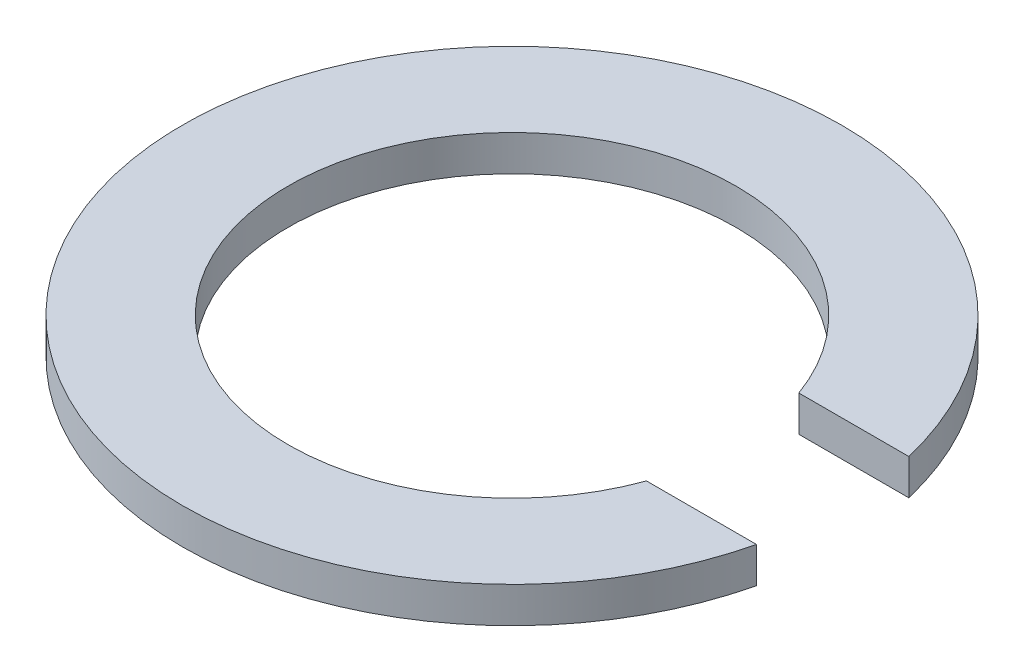
ISO-10303-21;
HEADER;
FILE_DESCRIPTION(('STEP AP214'),'2;1');
FILE_NAME('part.step','',(''),(''),'','','');
FILE_SCHEMA(('AUTOMOTIVE_DESIGN { 1 0 10303 214 1 1 1 1 }'));
ENDSEC;
DATA;
#1=APPLICATION_CONTEXT('core data for automotive mechanical design processes');
#2=APPLICATION_PROTOCOL_DEFINITION('international standard','automotive_design',2000,#1);
#3=PRODUCT_CONTEXT('',#1,'mechanical');
#4=PRODUCT('Part','Part','',(#3));
#5=PRODUCT_RELATED_PRODUCT_CATEGORY('part','',(#4));
#6=PRODUCT_DEFINITION_FORMATION('','',#4);
#7=PRODUCT_DEFINITION_CONTEXT('part definition',#1,'design');
#8=PRODUCT_DEFINITION('design','',#6,#7);
#9=PRODUCT_DEFINITION_SHAPE('','',#8);
#10=(LENGTH_UNIT() NAMED_UNIT(*) SI_UNIT(.MILLI.,.METRE.));
#11=(NAMED_UNIT(*) PLANE_ANGLE_UNIT() SI_UNIT($,.RADIAN.));
#12=(NAMED_UNIT(*) SI_UNIT($,.STERADIAN.) SOLID_ANGLE_UNIT());
#13=UNCERTAINTY_MEASURE_WITH_UNIT(LENGTH_MEASURE(1.E-05),#10,'distance_accuracy_value','');
#14=(GEOMETRIC_REPRESENTATION_CONTEXT(3) GLOBAL_UNCERTAINTY_ASSIGNED_CONTEXT((#13)) GLOBAL_UNIT_ASSIGNED_CONTEXT((#10,
#11,#12)) REPRESENTATION_CONTEXT('',''));
#15=CARTESIAN_POINT('',(0.,0.,0.));
#16=DIRECTION('',(0.,0.,1.));
#17=DIRECTION('',(1.,0.,0.));
#18=AXIS2_PLACEMENT_3D('',#15,#16,#17);
#19=CARTESIAN_POINT('',(81.8165427747986,13.9,-29.5813003159015));
#20=DIRECTION('',(0.,0.,-1.));
#21=DIRECTION('',(-1.,0.,0.));
#22=AXIS2_PLACEMENT_3D('',#19,#20,#21);
#23=PLANE('',#22);
#24=DIRECTION('',(1.,0.,0.));
#25=VECTOR('',#24,1.);
#26=CARTESIAN_POINT('',(81.8165427747986,0.,-29.5813003159015));
#27=LINE('',#26,#25);
#28=CARTESIAN_POINT('',(81.8165427747986,0.,-29.5813003159015));
#29=VERTEX_POINT('',#28);
#30=CARTESIAN_POINT('',(124.534921494416,0.,-29.5813003159015));
#31=VERTEX_POINT('',#30);
#32=EDGE_CURVE('E98',#29,#31,#27,.T.);
#33=ORIENTED_EDGE('',*,*,#32,.T.);
#34=DIRECTION('',(0.,-1.,0.));
#35=VECTOR('',#34,1.);
#36=CARTESIAN_POINT('',(124.534921494416,13.9,-29.5813003159015));
#37=LINE('',#36,#35);
#38=CARTESIAN_POINT('',(124.534921494416,13.9,-29.5813003159015));
#39=VERTEX_POINT('',#38);
#40=EDGE_CURVE('E11',#39,#31,#37,.T.);
#41=ORIENTED_EDGE('',*,*,#40,.F.);
#42=DIRECTION('',(1.,0.,0.));
#43=VECTOR('',#42,1.);
#44=CARTESIAN_POINT('',(81.8165427747986,13.9,-29.5813003159015));
#45=LINE('',#44,#43);
#46=CARTESIAN_POINT('',(81.8165427747986,13.9,-29.5813003159015));
#47=VERTEX_POINT('',#46);
#48=EDGE_CURVE('E84',#47,#39,#45,.T.);
#49=ORIENTED_EDGE('',*,*,#48,.F.);
#50=DIRECTION('',(0.,-1.,0.));
#51=VECTOR('',#50,1.);
#52=CARTESIAN_POINT('',(81.8165427747986,13.9,-29.5813003159015));
#53=LINE('',#52,#51);
#54=EDGE_CURVE('E51',#47,#29,#53,.T.);
#55=ORIENTED_EDGE('',*,*,#54,.T.);
#56=EDGE_LOOP('',(#33,#41,#49,#55));
#57=FACE_BOUND('',#56,.T.);
#58=ADVANCED_FACE('F35',(#57),#23,.F.);
#59=CARTESIAN_POINT('',(0.,13.9,0.));
#60=DIRECTION('',(0.,-1.,0.));
#61=DIRECTION('',(0.,0.,-1.));
#62=AXIS2_PLACEMENT_3D('',#59,#60,#61);
#63=CYLINDRICAL_SURFACE('',#62,128.);
#64=CARTESIAN_POINT('',(0.,0.,0.));
#65=DIRECTION('',(0.,1.,0.));
#66=DIRECTION('',(0.,0.,1.));
#67=AXIS2_PLACEMENT_3D('',#64,#65,#66);
#68=CIRCLE('',#67,128.);
#69=CARTESIAN_POINT('',(124.534958069237,0.,29.5811463383932));
#70=VERTEX_POINT('',#69);
#71=EDGE_CURVE('E89',#31,#70,#68,.T.);
#72=ORIENTED_EDGE('',*,*,#71,.T.);
#73=DIRECTION('',(0.,-1.,0.));
#74=VECTOR('',#73,1.);
#75=CARTESIAN_POINT('',(124.534958069237,13.9,29.5811463383932));
#76=LINE('',#75,#74);
#77=CARTESIAN_POINT('',(124.534958069237,13.9,29.5811463383932));
#78=VERTEX_POINT('',#77);
#79=EDGE_CURVE('E43',#78,#70,#76,.T.);
#80=ORIENTED_EDGE('',*,*,#79,.F.);
#81=CARTESIAN_POINT('',(0.,13.9,0.));
#82=DIRECTION('',(0.,1.,0.));
#83=DIRECTION('',(0.,0.,1.));
#84=AXIS2_PLACEMENT_3D('',#81,#82,#83);
#85=CIRCLE('',#84,128.);
#86=EDGE_CURVE('E76',#39,#78,#85,.T.);
#87=ORIENTED_EDGE('',*,*,#86,.F.);
#88=ORIENTED_EDGE('',*,*,#40,.T.);
#89=EDGE_LOOP('',(#72,#80,#87,#88));
#90=FACE_BOUND('',#89,.T.);
#91=ADVANCED_FACE('F88',(#90),#63,.T.);
#92=CARTESIAN_POINT('',(81.816598446199,13.9,29.5811463383932));
#93=DIRECTION('',(0.,0.,-1.));
#94=DIRECTION('',(-1.,0.,0.));
#95=AXIS2_PLACEMENT_3D('',#92,#93,#94);
#96=PLANE('',#95);
#97=DIRECTION('',(1.,0.,0.));
#98=VECTOR('',#97,1.);
#99=CARTESIAN_POINT('',(81.816598446199,0.,29.5811463383932));
#100=LINE('',#99,#98);
#101=CARTESIAN_POINT('',(81.816598446199,0.,29.5811463383932));
#102=VERTEX_POINT('',#101);
#103=EDGE_CURVE('E101',#102,#70,#100,.T.);
#104=ORIENTED_EDGE('',*,*,#103,.F.);
#105=DIRECTION('',(0.,-1.,0.));
#106=VECTOR('',#105,1.);
#107=CARTESIAN_POINT('',(81.816598446199,13.9,29.5811463383932));
#108=LINE('',#107,#106);
#109=CARTESIAN_POINT('',(81.816598446199,13.9,29.5811463383932));
#110=VERTEX_POINT('',#109);
#111=EDGE_CURVE('E65',#110,#102,#108,.T.);
#112=ORIENTED_EDGE('',*,*,#111,.F.);
#113=DIRECTION('',(1.,0.,0.));
#114=VECTOR('',#113,1.);
#115=CARTESIAN_POINT('',(81.816598446199,13.9,29.5811463383932));
#116=LINE('',#115,#114);
#117=EDGE_CURVE('E83',#110,#78,#116,.T.);
#118=ORIENTED_EDGE('',*,*,#117,.T.);
#119=ORIENTED_EDGE('',*,*,#79,.T.);
#120=EDGE_LOOP('',(#104,#112,#118,#119));
#121=FACE_BOUND('',#120,.T.);
#122=ADVANCED_FACE('F92',(#121),#96,.T.);
#123=CARTESIAN_POINT('',(0.,13.9,0.));
#124=DIRECTION('',(0.,-1.,0.));
#125=DIRECTION('',(0.,0.,-1.));
#126=AXIS2_PLACEMENT_3D('',#123,#124,#125);
#127=CYLINDRICAL_SURFACE('',#126,87.);
#128=CARTESIAN_POINT('',(0.,0.,0.));
#129=DIRECTION('',(0.,1.,0.));
#130=DIRECTION('',(0.,0.,1.));
#131=AXIS2_PLACEMENT_3D('',#128,#129,#130);
#132=CIRCLE('',#131,87.);
#133=EDGE_CURVE('E103',#29,#102,#132,.T.);
#134=ORIENTED_EDGE('',*,*,#133,.F.);
#135=ORIENTED_EDGE('',*,*,#54,.F.);
#136=CARTESIAN_POINT('',(0.,13.9,0.));
#137=DIRECTION('',(0.,1.,0.));
#138=DIRECTION('',(0.,0.,1.));
#139=AXIS2_PLACEMENT_3D('',#136,#137,#138);
#140=CIRCLE('',#139,87.);
#141=EDGE_CURVE('E93',#47,#110,#140,.T.);
#142=ORIENTED_EDGE('',*,*,#141,.T.);
#143=ORIENTED_EDGE('',*,*,#111,.T.);
#144=EDGE_LOOP('',(#134,#135,#142,#143));
#145=FACE_BOUND('',#144,.T.);
#146=ADVANCED_FACE('F109',(#145),#127,.F.);
#147=CARTESIAN_POINT('',(0.,13.9,0.));
#148=DIRECTION('',(0.,1.,0.));
#149=DIRECTION('',(0.,0.,1.));
#150=AXIS2_PLACEMENT_3D('',#147,#148,#149);
#151=PLANE('',#150);
#152=ORIENTED_EDGE('',*,*,#48,.T.);
#153=ORIENTED_EDGE('',*,*,#86,.T.);
#154=ORIENTED_EDGE('',*,*,#117,.F.);
#155=ORIENTED_EDGE('',*,*,#141,.F.);
#156=EDGE_LOOP('',(#152,#153,#154,#155));
#157=FACE_BOUND('',#156,.T.);
#158=ADVANCED_FACE('F80',(#157),#151,.T.);
#159=CARTESIAN_POINT('',(0.,0.,0.));
#160=DIRECTION('',(0.,1.,0.));
#161=DIRECTION('',(0.,0.,1.));
#162=AXIS2_PLACEMENT_3D('',#159,#160,#161);
#163=PLANE('',#162);
#164=ORIENTED_EDGE('',*,*,#32,.F.);
#165=ORIENTED_EDGE('',*,*,#133,.T.);
#166=ORIENTED_EDGE('',*,*,#103,.T.);
#167=ORIENTED_EDGE('',*,*,#71,.F.);
#168=EDGE_LOOP('',(#164,#165,#166,#167));
#169=FACE_BOUND('',#168,.T.);
#170=ADVANCED_FACE('F108',(#169),#163,.F.);
#171=CLOSED_SHELL('',(#58,#91,#122,#146,#158,#170));
#172=MANIFOLD_SOLID_BREP('B2',#171);
#173=ADVANCED_BREP_SHAPE_REPRESENTATION('',(#18,#172),#14);
#174=SHAPE_DEFINITION_REPRESENTATION(#9,#173);
ENDSEC;
END-ISO-10303-21;
